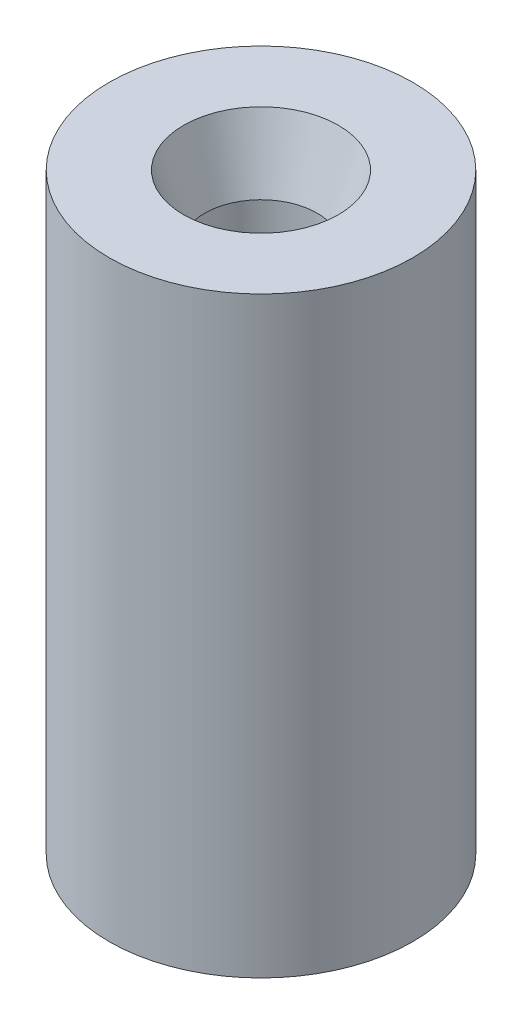
ISO-10303-21;
HEADER;
FILE_DESCRIPTION(('STEP AP214'),'2;1');
FILE_NAME('part.step','',(''),(''),'','','');
FILE_SCHEMA(('AUTOMOTIVE_DESIGN { 1 0 10303 214 1 1 1 1 }'));
ENDSEC;
DATA;
#1=APPLICATION_CONTEXT('core data for automotive mechanical design processes');
#2=APPLICATION_PROTOCOL_DEFINITION('international standard','automotive_design',2000,#1);
#3=PRODUCT_CONTEXT('',#1,'mechanical');
#4=PRODUCT('Part','Part','',(#3));
#5=PRODUCT_RELATED_PRODUCT_CATEGORY('part','',(#4));
#6=PRODUCT_DEFINITION_FORMATION('','',#4);
#7=PRODUCT_DEFINITION_CONTEXT('part definition',#1,'design');
#8=PRODUCT_DEFINITION('design','',#6,#7);
#9=PRODUCT_DEFINITION_SHAPE('','',#8);
#10=(LENGTH_UNIT() NAMED_UNIT(*) SI_UNIT(.MILLI.,.METRE.));
#11=(NAMED_UNIT(*) PLANE_ANGLE_UNIT() SI_UNIT($,.RADIAN.));
#12=(NAMED_UNIT(*) SI_UNIT($,.STERADIAN.) SOLID_ANGLE_UNIT());
#13=UNCERTAINTY_MEASURE_WITH_UNIT(LENGTH_MEASURE(1.E-05),#10,'distance_accuracy_value','');
#14=(GEOMETRIC_REPRESENTATION_CONTEXT(3) GLOBAL_UNCERTAINTY_ASSIGNED_CONTEXT((#13)) GLOBAL_UNIT_ASSIGNED_CONTEXT((#10,
#11,#12)) REPRESENTATION_CONTEXT('',''));
#15=CARTESIAN_POINT('',(0.,0.,0.));
#16=DIRECTION('',(0.,0.,1.));
#17=DIRECTION('',(1.,0.,0.));
#18=AXIS2_PLACEMENT_3D('',#15,#16,#17);
#19=CARTESIAN_POINT('',(0.,19.5,0.));
#20=DIRECTION('',(0.,-1.,0.));
#21=DIRECTION('',(0.,0.,-1.));
#22=AXIS2_PLACEMENT_3D('',#19,#20,#21);
#23=CYLINDRICAL_SURFACE('',#22,5.);
#24=CARTESIAN_POINT('',(0.,19.5,0.));
#25=DIRECTION('',(0.,1.,0.));
#26=DIRECTION('',(0.,0.,1.));
#27=AXIS2_PLACEMENT_3D('',#24,#25,#26);
#28=CIRCLE('',#27,5.);
#29=CARTESIAN_POINT('',(0.,19.5,5.));
#30=VERTEX_POINT('',#29);
#31=EDGE_CURVE('E70',#30,#30,#28,.T.);
#32=ORIENTED_EDGE('',*,*,#31,.F.);
#33=EDGE_LOOP('',(#32));
#34=FACE_BOUND('',#33,.T.);
#35=CARTESIAN_POINT('',(0.,0.,0.));
#36=DIRECTION('',(0.,1.,0.));
#37=DIRECTION('',(0.,0.,1.));
#38=AXIS2_PLACEMENT_3D('',#35,#36,#37);
#39=CIRCLE('',#38,5.);
#40=CARTESIAN_POINT('',(0.,0.,5.));
#41=VERTEX_POINT('',#40);
#42=EDGE_CURVE('E71',#41,#41,#39,.T.);
#43=ORIENTED_EDGE('',*,*,#42,.T.);
#44=EDGE_LOOP('',(#43));
#45=FACE_BOUND('',#44,.T.);
#46=ADVANCED_FACE('F45',(#34,#45),#23,.T.);
#47=CARTESIAN_POINT('',(0.,19.5,0.));
#48=DIRECTION('',(0.,1.,0.));
#49=DIRECTION('',(0.,0.,1.));
#50=AXIS2_PLACEMENT_3D('',#47,#48,#49);
#51=PLANE('',#50);
#52=CARTESIAN_POINT('',(0.,19.5,0.));
#53=DIRECTION('',(0.,1.,0.));
#54=DIRECTION('',(0.,0.,1.));
#55=AXIS2_PLACEMENT_3D('',#52,#53,#54);
#56=CIRCLE('',#55,2.55000000000001);
#57=CARTESIAN_POINT('',(0.,19.5,2.55000000000001));
#58=VERTEX_POINT('',#57);
#59=EDGE_CURVE('E10',#58,#58,#56,.F.);
#60=ORIENTED_EDGE('',*,*,#59,.T.);
#61=EDGE_LOOP('',(#60));
#62=FACE_BOUND('',#61,.T.);
#63=ORIENTED_EDGE('',*,*,#31,.T.);
#64=EDGE_LOOP('',(#63));
#65=FACE_BOUND('',#64,.T.);
#66=ADVANCED_FACE('F79',(#62,#65),#51,.T.);
#67=CARTESIAN_POINT('',(0.,0.,0.));
#68=DIRECTION('',(0.,1.,0.));
#69=DIRECTION('',(0.,0.,1.));
#70=AXIS2_PLACEMENT_3D('',#67,#68,#69);
#71=PLANE('',#70);
#72=CARTESIAN_POINT('',(0.,0.,0.));
#73=DIRECTION('',(0.,1.,0.));
#74=DIRECTION('',(0.,0.,1.));
#75=AXIS2_PLACEMENT_3D('',#72,#73,#74);
#76=CIRCLE('',#75,2.55);
#77=CARTESIAN_POINT('',(0.,0.,2.55));
#78=VERTEX_POINT('',#77);
#79=EDGE_CURVE('E64',#78,#78,#76,.T.);
#80=ORIENTED_EDGE('',*,*,#79,.T.);
#81=EDGE_LOOP('',(#80));
#82=FACE_BOUND('',#81,.T.);
#83=ORIENTED_EDGE('',*,*,#42,.F.);
#84=EDGE_LOOP('',(#83));
#85=FACE_BOUND('',#84,.T.);
#86=ADVANCED_FACE('F86',(#82,#85),#71,.F.);
#87=CARTESIAN_POINT('',(0.,-7.,0.));
#88=DIRECTION('',(0.,1.,0.));
#89=DIRECTION('',(0.,0.,1.));
#90=AXIS2_PLACEMENT_3D('',#87,#88,#89);
#91=CYLINDRICAL_SURFACE('',#90,1.85);
#92=CARTESIAN_POINT('',(0.,2.15437847602266,0.));
#93=DIRECTION('',(0.,1.,0.));
#94=DIRECTION('',(0.,0.,1.));
#95=AXIS2_PLACEMENT_3D('',#92,#93,#94);
#96=CIRCLE('',#95,1.85);
#97=CARTESIAN_POINT('',(0.,2.15437847602266,1.85));
#98=VERTEX_POINT('',#97);
#99=EDGE_CURVE('E54',#98,#98,#96,.F.);
#100=ORIENTED_EDGE('',*,*,#99,.T.);
#101=EDGE_LOOP('',(#100));
#102=FACE_BOUND('',#101,.T.);
#103=CARTESIAN_POINT('',(0.,17.3456215239773,0.));
#104=DIRECTION('',(0.,1.,0.));
#105=DIRECTION('',(0.,0.,1.));
#106=AXIS2_PLACEMENT_3D('',#103,#104,#105);
#107=CIRCLE('',#106,1.85);
#108=CARTESIAN_POINT('',(0.,17.3456215239773,1.85));
#109=VERTEX_POINT('',#108);
#110=EDGE_CURVE('E59',#109,#109,#107,.T.);
#111=ORIENTED_EDGE('',*,*,#110,.T.);
#112=EDGE_LOOP('',(#111));
#113=FACE_BOUND('',#112,.T.);
#114=ADVANCED_FACE('F88',(#102,#113),#91,.F.);
#115=CARTESIAN_POINT('',(0.,0.,0.));
#116=DIRECTION('',(0.,-1.,0.));
#117=DIRECTION('',(0.,0.,-1.));
#118=AXIS2_PLACEMENT_3D('',#115,#116,#117);
#119=CONICAL_SURFACE('',#118,2.55,0.31415926535898);
#120=ORIENTED_EDGE('',*,*,#99,.F.);
#121=EDGE_LOOP('',(#120));
#122=FACE_BOUND('',#121,.T.);
#123=ORIENTED_EDGE('',*,*,#79,.F.);
#124=EDGE_LOOP('',(#123));
#125=FACE_BOUND('',#124,.T.);
#126=ADVANCED_FACE('F95',(#122,#125),#119,.F.);
#127=CARTESIAN_POINT('',(0.,17.3456215239773,0.));
#128=DIRECTION('',(0.,1.,0.));
#129=DIRECTION('',(0.,0.,1.));
#130=AXIS2_PLACEMENT_3D('',#127,#128,#129);
#131=CONICAL_SURFACE('',#130,1.85,0.314159265358982);
#132=ORIENTED_EDGE('',*,*,#59,.F.);
#133=EDGE_LOOP('',(#132));
#134=FACE_BOUND('',#133,.T.);
#135=ORIENTED_EDGE('',*,*,#110,.F.);
#136=EDGE_LOOP('',(#135));
#137=FACE_BOUND('',#136,.T.);
#138=ADVANCED_FACE('F48',(#134,#137),#131,.F.);
#139=CLOSED_SHELL('',(#46,#66,#86,#114,#126,#138));
#140=MANIFOLD_SOLID_BREP('B2',#139);
#141=ADVANCED_BREP_SHAPE_REPRESENTATION('',(#18,#140),#14);
#142=SHAPE_DEFINITION_REPRESENTATION(#9,#141);
ENDSEC;
END-ISO-10303-21;
